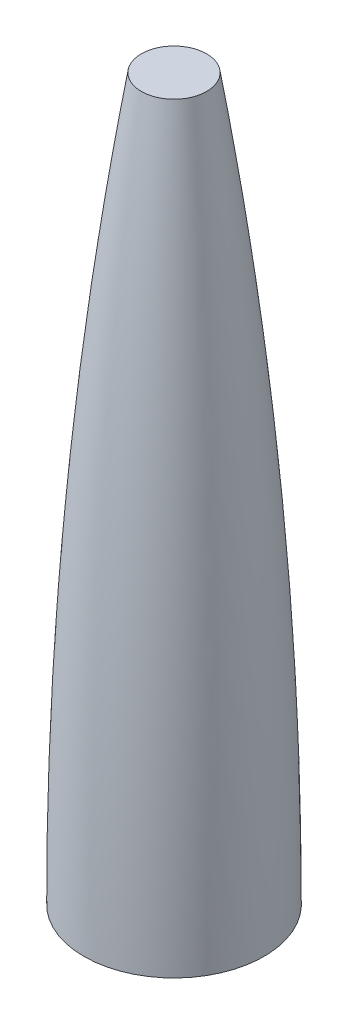
ISO-10303-21;
HEADER;
FILE_DESCRIPTION(('STEP AP214'),'2;1');
FILE_NAME('part.step','',(''),(''),'','','');
FILE_SCHEMA(('AUTOMOTIVE_DESIGN { 1 0 10303 214 1 1 1 1 }'));
ENDSEC;
DATA;
#1=APPLICATION_CONTEXT('core data for automotive mechanical design processes');
#2=APPLICATION_PROTOCOL_DEFINITION('international standard','automotive_design',2000,#1);
#3=PRODUCT_CONTEXT('',#1,'mechanical');
#4=PRODUCT('Part','Part','',(#3));
#5=PRODUCT_RELATED_PRODUCT_CATEGORY('part','',(#4));
#6=PRODUCT_DEFINITION_FORMATION('','',#4);
#7=PRODUCT_DEFINITION_CONTEXT('part definition',#1,'design');
#8=PRODUCT_DEFINITION('design','',#6,#7);
#9=PRODUCT_DEFINITION_SHAPE('','',#8);
#10=(LENGTH_UNIT() NAMED_UNIT(*) SI_UNIT(.MILLI.,.METRE.));
#11=(NAMED_UNIT(*) PLANE_ANGLE_UNIT() SI_UNIT($,.RADIAN.));
#12=(NAMED_UNIT(*) SI_UNIT($,.STERADIAN.) SOLID_ANGLE_UNIT());
#13=UNCERTAINTY_MEASURE_WITH_UNIT(LENGTH_MEASURE(1.E-05),#10,'distance_accuracy_value','');
#14=(GEOMETRIC_REPRESENTATION_CONTEXT(3) GLOBAL_UNCERTAINTY_ASSIGNED_CONTEXT((#13)) GLOBAL_UNIT_ASSIGNED_CONTEXT((#10,
#11,#12)) REPRESENTATION_CONTEXT('',''));
#15=CARTESIAN_POINT('',(0.,0.,0.));
#16=DIRECTION('',(0.,0.,1.));
#17=DIRECTION('',(1.,0.,0.));
#18=AXIS2_PLACEMENT_3D('',#15,#16,#17);
#19=CARTESIAN_POINT('',(0.,0.,0.));
#20=DIRECTION('',(0.,-1.,0.));
#21=DIRECTION('',(0.,0.,-1.));
#22=AXIS2_PLACEMENT_3D('',#19,#20,#21);
#23=CYLINDRICAL_SURFACE('',#22,95.2500000000083);
#24=CARTESIAN_POINT('',(0.,3.17500000000067,0.));
#25=DIRECTION('',(0.,-1.,0.));
#26=DIRECTION('',(0.,0.,-1.));
#27=AXIS2_PLACEMENT_3D('',#24,#25,#26);
#28=CIRCLE('',#27,95.2500000000083);
#29=CARTESIAN_POINT('',(0.,3.17500000000067,-95.2500000000083));
#30=VERTEX_POINT('',#29);
#31=EDGE_CURVE('E57',#30,#30,#28,.T.);
#32=ORIENTED_EDGE('',*,*,#31,.F.);
#33=EDGE_LOOP('',(#32));
#34=FACE_BOUND('',#33,.T.);
#35=CARTESIAN_POINT('',(0.,0.,0.));
#36=DIRECTION('',(0.,-1.,0.));
#37=DIRECTION('',(0.,0.,-1.));
#38=AXIS2_PLACEMENT_3D('',#35,#36,#37);
#39=CIRCLE('',#38,95.2500000000083);
#40=CARTESIAN_POINT('',(0.,0.,-95.2500000000083));
#41=VERTEX_POINT('',#40);
#42=EDGE_CURVE('E42',#41,#41,#39,.T.);
#43=ORIENTED_EDGE('',*,*,#42,.T.);
#44=EDGE_LOOP('',(#43));
#45=FACE_BOUND('',#44,.T.);
#46=ADVANCED_FACE('F38',(#34,#45),#23,.F.);
#47=CARTESIAN_POINT('',(1.71600060805526E-11,809.625,0.));
#48=DIRECTION('',(0.,-1.,0.));
#49=DIRECTION('',(0.,0.,-1.));
#50=AXIS2_PLACEMENT_3D('',#47,#48,#49);
#51=PLANE('',#50);
#52=CARTESIAN_POINT('',(0.,809.625,0.));
#53=DIRECTION('',(0.,-1.,0.));
#54=DIRECTION('',(0.,0.,-1.));
#55=AXIS2_PLACEMENT_3D('',#52,#53,#54);
#56=CIRCLE('',#55,34.103598259922);
#57=CARTESIAN_POINT('',(0.,809.625,-34.103598259922));
#58=VERTEX_POINT('',#57);
#59=EDGE_CURVE('E50',#58,#58,#56,.T.);
#60=ORIENTED_EDGE('',*,*,#59,.T.);
#61=EDGE_LOOP('',(#60));
#62=FACE_BOUND('',#61,.T.);
#63=ADVANCED_FACE('F77',(#62),#51,.T.);
#64=CARTESIAN_POINT('',(-36.8107382436399,812.800000000088,0.));
#65=CARTESIAN_POINT('',(-36.9942778675381,811.656036287534,0.));
#66=CARTESIAN_POINT('',(-37.3628701438847,809.352341120219,0.));
#67=CARTESIAN_POINT('',(-38.4059770860057,802.812851723432,0.));
#68=CARTESIAN_POINT('',(-39.4063445534059,796.466868939399,0.));
#69=CARTESIAN_POINT('',(-40.5094000899044,789.417479858415,0.));
#70=CARTESIAN_POINT('',(-41.5636705533657,782.608785029749,0.));
#71=CARTESIAN_POINT('',(-42.4113425012624,777.097281594064,0.));
#72=CARTESIAN_POINT('',(-43.2542378182177,771.576058872733,0.));
#73=CARTESIAN_POINT('',(-44.0966419124056,766.017705101634,0.));
#74=CARTESIAN_POINT('',(-44.9372574635269,760.429599919701,0.));
#75=CARTESIAN_POINT('',(-45.7762764460643,754.809835943887,0.));
#76=CARTESIAN_POINT('',(-46.8172442930843,747.784136419474,0.));
#77=CARTESIAN_POINT('',(-48.0539669097659,739.351391314448,0.));
#78=CARTESIAN_POINT('',(-49.4786435972294,729.510576954662,0.));
#79=CARTESIAN_POINT('',(-51.8835815258252,712.635208419306,0.));
#80=CARTESIAN_POINT('',(-56.1784053374686,681.680921395609,0.));
#81=CARTESIAN_POINT('',(-64.3108872319733,619.70971154683,0.));
#82=CARTESIAN_POINT('',(-79.9569813158618,484.234101922189,0.));
#83=CARTESIAN_POINT('',(-91.5619165522518,342.613670709071,0.));
#84=CARTESIAN_POINT('',(-98.2796599898014,206.379377523321,0.));
#85=CARTESIAN_POINT('',(-100.665151632326,101.288631045201,0.));
#86=CARTESIAN_POINT('',(-101.121916521398,71.4617361512993,0.));
#87=CARTESIAN_POINT('',(-101.305723043407,55.1271513591144,0.));
#88=CARTESIAN_POINT('',(-101.362315117216,49.445475511436,0.));
#89=CARTESIAN_POINT('',(-101.40133044313,45.2148835602699,0.));
#90=CARTESIAN_POINT('',(-101.436995751518,41.014909000731,0.));
#91=CARTESIAN_POINT('',(-101.474006364349,36.1352064160095,0.));
#92=CARTESIAN_POINT('',(-101.510147859518,30.5749997133623,0.));
#93=CARTESIAN_POINT('',(-101.540265836947,25.0243241942418,0.));
#94=CARTESIAN_POINT('',(-101.564360261357,19.4325637363225,0.));
#95=CARTESIAN_POINT('',(-101.582431104395,13.9273200626215,0.));
#96=CARTESIAN_POINT('',(-101.594478344888,8.48550626468115,0.));
#97=CARTESIAN_POINT('',(-101.598996062713,3.49324912068522,0.));
#98=CARTESIAN_POINT('',(-101.600000000008,1.15859381780288,0.));
#99=CARTESIAN_POINT('',(-101.600000000008,3.29251402703047E-12,0.));
#100=B_SPLINE_CURVE_WITH_KNOTS('',4,(#64,#65,#66,#67,#68,#69,#70,#71,#72,#73,#74,#75,#76,#77,
#78,#79,#80,#81,#82,#83,#84,#85,#86,#87,#88,#89,#90,#91,#92,#93,#94,#95,#96,#97,#98,#99),
.UNSPECIFIED.,.F.,.F.,(5,1,1,1,1,1,1,1,1,1,1,1,1,1,1,1,1,1,1,1,1,1,1,1,1,1,1,1,1,1,1,1,5),
(0.0833623092059593,0.0890400308531439,0.0947177525003284,0.106073195794698,0.111750917441882,
0.117428639089067,0.123106360736251,0.128784082383436,0.134587047619085,0.140390012854735,
0.146192978090384,0.151995943326034,0.163601873797332,0.175207804268631,0.186813734709129,
0.22163152603062,0.291267108032858,0.430538273603116,0.743898395082925,0.801928047381381,
0.84835176909009,0.859957699551707,0.865760664782516,0.86866214739792,0.871563630013324,
0.87724135137609,0.882919072738856,0.888596794101622,0.894274515464387,0.899952236827153,
0.905629958189919,0.911307679552684,0.91698540091545),.UNSPECIFIED.);
#101=CARTESIAN_POINT('',(0.,0.,0.));
#102=DIRECTION('',(0.,-1.,0.));
#103=AXIS1_PLACEMENT('',#101,#102);
#104=SURFACE_OF_REVOLUTION('',#100,#103);
#105=OFFSET_SURFACE('',#104,-3.175,.F.);
#106=CARTESIAN_POINT('',(0.,3.17500000000069,0.));
#107=DIRECTION('',(0.,-1.,0.));
#108=DIRECTION('',(0.,0.,-1.));
#109=AXIS2_PLACEMENT_3D('',#106,#107,#108);
#110=CIRCLE('',#109,98.4237614677854);
#111=CARTESIAN_POINT('',(0.,3.17500000000069,-98.4237614677854));
#112=VERTEX_POINT('',#111);
#113=EDGE_CURVE('E91',#112,#112,#110,.T.);
#114=ORIENTED_EDGE('',*,*,#113,.T.);
#115=EDGE_LOOP('',(#114));
#116=FACE_BOUND('',#115,.T.);
#117=ORIENTED_EDGE('',*,*,#59,.F.);
#118=EDGE_LOOP('',(#117));
#119=FACE_BOUND('',#118,.T.);
#120=ADVANCED_FACE('F70',(#116,#119),#105,.F.);
#121=CARTESIAN_POINT('',(0.,3.17500000000067,0.));
#122=DIRECTION('',(0.,-1.,0.));
#123=DIRECTION('',(0.,0.,-1.));
#124=AXIS2_PLACEMENT_3D('',#121,#122,#123);
#125=PLANE('',#124);
#126=ORIENTED_EDGE('',*,*,#113,.F.);
#127=EDGE_LOOP('',(#126));
#128=FACE_BOUND('',#127,.T.);
#129=ORIENTED_EDGE('',*,*,#31,.T.);
#130=EDGE_LOOP('',(#129));
#131=FACE_BOUND('',#130,.T.);
#132=ADVANCED_FACE('F72',(#128,#131),#125,.F.);
#133=CARTESIAN_POINT('',(1.71600060805526E-11,812.8,0.));
#134=DIRECTION('',(0.,-1.,0.));
#135=DIRECTION('',(0.,0.,-1.));
#136=AXIS2_PLACEMENT_3D('',#133,#134,#135);
#137=PLANE('',#136);
#138=CARTESIAN_POINT('',(0.,812.800000000001,0.));
#139=DIRECTION('',(0.,-1.,0.));
#140=DIRECTION('',(0.,0.,-1.));
#141=AXIS2_PLACEMENT_3D('',#138,#139,#140);
#142=CIRCLE('',#141,36.8107382436538);
#143=CARTESIAN_POINT('',(0.,812.800000000001,-36.8107382436538));
#144=VERTEX_POINT('',#143);
#145=EDGE_CURVE('E10',#144,#144,#142,.T.);
#146=ORIENTED_EDGE('',*,*,#145,.F.);
#147=EDGE_LOOP('',(#146));
#148=FACE_BOUND('',#147,.T.);
#149=ADVANCED_FACE('F40',(#148),#137,.F.);
#150=CARTESIAN_POINT('',(0.,6.66133814775094E-13,0.));
#151=DIRECTION('',(0.,-1.,0.));
#152=DIRECTION('',(0.,0.,-1.));
#153=AXIS2_PLACEMENT_3D('',#150,#151,#152);
#154=PLANE('',#153);
#155=CARTESIAN_POINT('',(0.,1.33226762955019E-12,0.));
#156=DIRECTION('',(0.,-1.,0.));
#157=DIRECTION('',(0.,0.,-1.));
#158=AXIS2_PLACEMENT_3D('',#155,#156,#157);
#159=CIRCLE('',#158,101.600000000008);
#160=CARTESIAN_POINT('',(0.,1.33226762955019E-12,-101.600000000008));
#161=VERTEX_POINT('',#160);
#162=EDGE_CURVE('E46',#161,#161,#159,.T.);
#163=ORIENTED_EDGE('',*,*,#162,.T.);
#164=EDGE_LOOP('',(#163));
#165=FACE_BOUND('',#164,.T.);
#166=ORIENTED_EDGE('',*,*,#42,.F.);
#167=EDGE_LOOP('',(#166));
#168=FACE_BOUND('',#167,.T.);
#169=ADVANCED_FACE('F68',(#165,#168),#154,.T.);
#170=CARTESIAN_POINT('',(-36.8107382436399,812.800000000088,0.));
#171=CARTESIAN_POINT('',(-36.9942778675381,811.656036287534,0.));
#172=CARTESIAN_POINT('',(-37.3628701438847,809.352341120219,0.));
#173=CARTESIAN_POINT('',(-38.4059770860057,802.812851723432,0.));
#174=CARTESIAN_POINT('',(-39.4063445534059,796.466868939399,0.));
#175=CARTESIAN_POINT('',(-40.5094000899044,789.417479858415,0.));
#176=CARTESIAN_POINT('',(-41.5636705533657,782.608785029749,0.));
#177=CARTESIAN_POINT('',(-42.4113425012624,777.097281594064,0.));
#178=CARTESIAN_POINT('',(-43.2542378182177,771.576058872733,0.));
#179=CARTESIAN_POINT('',(-44.0966419124056,766.017705101634,0.));
#180=CARTESIAN_POINT('',(-44.9372574635269,760.429599919701,0.));
#181=CARTESIAN_POINT('',(-45.7762764460643,754.809835943887,0.));
#182=CARTESIAN_POINT('',(-46.8172442930843,747.784136419474,0.));
#183=CARTESIAN_POINT('',(-48.0539669097659,739.351391314448,0.));
#184=CARTESIAN_POINT('',(-49.4786435972294,729.510576954662,0.));
#185=CARTESIAN_POINT('',(-51.8835815258252,712.635208419306,0.));
#186=CARTESIAN_POINT('',(-56.1784053374686,681.680921395609,0.));
#187=CARTESIAN_POINT('',(-64.3108872319733,619.70971154683,0.));
#188=CARTESIAN_POINT('',(-79.9569813158618,484.234101922189,0.));
#189=CARTESIAN_POINT('',(-91.5619165522518,342.613670709071,0.));
#190=CARTESIAN_POINT('',(-98.2796599898014,206.379377523321,0.));
#191=CARTESIAN_POINT('',(-100.665151632326,101.288631045201,0.));
#192=CARTESIAN_POINT('',(-101.121916521398,71.4617361512993,0.));
#193=CARTESIAN_POINT('',(-101.305723043407,55.1271513591144,0.));
#194=CARTESIAN_POINT('',(-101.362315117216,49.445475511436,0.));
#195=CARTESIAN_POINT('',(-101.40133044313,45.2148835602699,0.));
#196=CARTESIAN_POINT('',(-101.436995751518,41.014909000731,0.));
#197=CARTESIAN_POINT('',(-101.474006364349,36.1352064160095,0.));
#198=CARTESIAN_POINT('',(-101.510147859518,30.5749997133623,0.));
#199=CARTESIAN_POINT('',(-101.540265836947,25.0243241942418,0.));
#200=CARTESIAN_POINT('',(-101.564360261357,19.4325637363225,0.));
#201=CARTESIAN_POINT('',(-101.582431104395,13.9273200626215,0.));
#202=CARTESIAN_POINT('',(-101.594478344888,8.48550626468115,0.));
#203=CARTESIAN_POINT('',(-101.598996062713,3.49324912068522,0.));
#204=CARTESIAN_POINT('',(-101.600000000008,1.15859381780288,0.));
#205=CARTESIAN_POINT('',(-101.600000000008,3.29251402703047E-12,0.));
#206=B_SPLINE_CURVE_WITH_KNOTS('',4,(#170,#171,#172,#173,#174,#175,#176,#177,#178,#179,#180,
#181,#182,#183,#184,#185,#186,#187,#188,#189,#190,#191,#192,#193,#194,#195,#196,#197,#198,#199,
#200,#201,#202,#203,#204,#205),.UNSPECIFIED.,.F.,.F.,(5,1,1,1,1,1,1,1,1,1,1,1,1,1,1,1,1,1,1,1,1,
1,1,1,1,1,1,1,1,1,1,1,5),(0.0833623092059593,0.0890400308531439,0.0947177525003284,
0.106073195794698,0.111750917441882,0.117428639089067,0.123106360736251,0.128784082383436,
0.134587047619085,0.140390012854735,0.146192978090384,0.151995943326034,0.163601873797332,
0.175207804268631,0.186813734709129,0.22163152603062,0.291267108032858,0.430538273603116,
0.743898395082925,0.801928047381381,0.84835176909009,0.859957699551707,0.865760664782516,
0.86866214739792,0.871563630013324,0.87724135137609,0.882919072738856,0.888596794101622,
0.894274515464387,0.899952236827153,0.905629958189919,0.911307679552684,0.91698540091545),.UNSPECIFIED.);
#207=CARTESIAN_POINT('',(0.,0.,0.));
#208=DIRECTION('',(0.,-1.,0.));
#209=AXIS1_PLACEMENT('',#207,#208);
#210=SURFACE_OF_REVOLUTION('',#206,#209);
#211=ORIENTED_EDGE('',*,*,#162,.F.);
#212=EDGE_LOOP('',(#211));
#213=FACE_BOUND('',#212,.T.);
#214=ORIENTED_EDGE('',*,*,#145,.T.);
#215=EDGE_LOOP('',(#214));
#216=FACE_BOUND('',#215,.T.);
#217=ADVANCED_FACE('F63',(#213,#216),#210,.T.);
#218=CLOSED_SHELL('',(#46,#63,#120,#132,#149,#169,#217));
#219=MANIFOLD_SOLID_BREP('B2',#218);
#220=ADVANCED_BREP_SHAPE_REPRESENTATION('',(#18,#219),#14);
#221=SHAPE_DEFINITION_REPRESENTATION(#9,#220);
ENDSEC;
END-ISO-10303-21;
